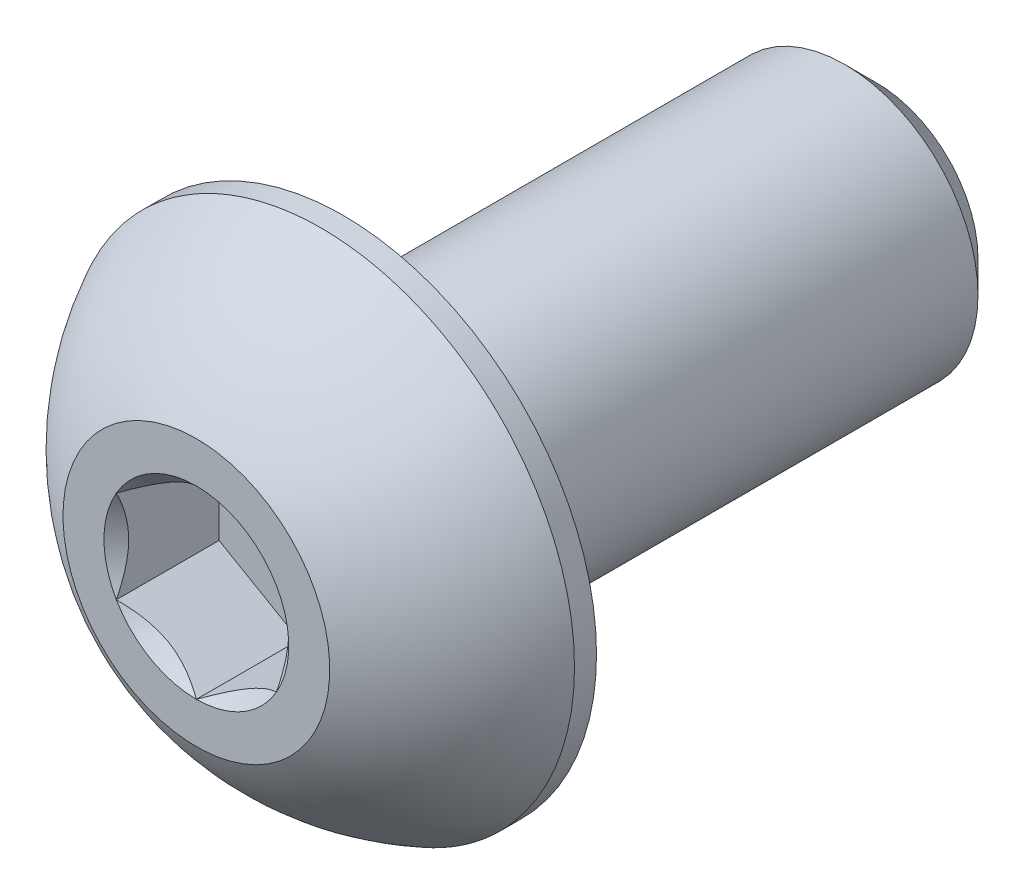
ISO-10303-21;
HEADER;
FILE_DESCRIPTION(('STEP AP214'),'2;1');
FILE_NAME('part.step','',(''),(''),'','','');
FILE_SCHEMA(('AUTOMOTIVE_DESIGN { 1 0 10303 214 1 1 1 1 }'));
ENDSEC;
DATA;
#1=APPLICATION_CONTEXT('core data for automotive mechanical design processes');
#2=APPLICATION_PROTOCOL_DEFINITION('international standard','automotive_design',2000,#1);
#3=PRODUCT_CONTEXT('',#1,'mechanical');
#4=PRODUCT('Part','Part','',(#3));
#5=PRODUCT_RELATED_PRODUCT_CATEGORY('part','',(#4));
#6=PRODUCT_DEFINITION_FORMATION('','',#4);
#7=PRODUCT_DEFINITION_CONTEXT('part definition',#1,'design');
#8=PRODUCT_DEFINITION('design','',#6,#7);
#9=PRODUCT_DEFINITION_SHAPE('','',#8);
#10=(LENGTH_UNIT() NAMED_UNIT(*) SI_UNIT(.MILLI.,.METRE.));
#11=(NAMED_UNIT(*) PLANE_ANGLE_UNIT() SI_UNIT($,.RADIAN.));
#12=(NAMED_UNIT(*) SI_UNIT($,.STERADIAN.) SOLID_ANGLE_UNIT());
#13=UNCERTAINTY_MEASURE_WITH_UNIT(LENGTH_MEASURE(1.E-05),#10,'distance_accuracy_value','');
#14=(GEOMETRIC_REPRESENTATION_CONTEXT(3) GLOBAL_UNCERTAINTY_ASSIGNED_CONTEXT((#13)) GLOBAL_UNIT_ASSIGNED_CONTEXT((#10,
#11,#12)) REPRESENTATION_CONTEXT('',''));
#15=CARTESIAN_POINT('',(0.,0.,0.));
#16=DIRECTION('',(0.,0.,1.));
#17=DIRECTION('',(1.,0.,0.));
#18=AXIS2_PLACEMENT_3D('',#15,#16,#17);
#19=CARTESIAN_POINT('',(1.5,-0.866025403784438,-1.925));
#20=DIRECTION('',(0.,0.,1.));
#21=DIRECTION('',(1.,0.,0.));
#22=AXIS2_PLACEMENT_3D('',#19,#20,#21);
#23=PLANE('',#22);
#24=DIRECTION('',(0.,1.,0.));
#25=VECTOR('',#24,1.);
#26=CARTESIAN_POINT('',(-1.5,0.866025403784438,-1.925));
#27=LINE('',#26,#25);
#28=CARTESIAN_POINT('',(-1.5,0.866025403784439,-1.925));
#29=VERTEX_POINT('',#28);
#30=CARTESIAN_POINT('',(-1.5,-0.866025403784439,-1.925));
#31=VERTEX_POINT('',#30);
#32=EDGE_CURVE('E77',#29,#31,#27,.F.);
#33=ORIENTED_EDGE('',*,*,#32,.T.);
#34=DIRECTION('',(0.866025403784439,-0.5,0.));
#35=VECTOR('',#34,1.);
#36=CARTESIAN_POINT('',(-1.5,-0.866025403784439,-1.925));
#37=LINE('',#36,#35);
#38=CARTESIAN_POINT('',(0.,-1.73205080756888,-1.925));
#39=VERTEX_POINT('',#38);
#40=EDGE_CURVE('E95',#31,#39,#37,.T.);
#41=ORIENTED_EDGE('',*,*,#40,.T.);
#42=DIRECTION('',(0.866025403784438,0.5,0.));
#43=VECTOR('',#42,1.);
#44=CARTESIAN_POINT('',(0.,-1.73205080756888,-1.925));
#45=LINE('',#44,#43);
#46=CARTESIAN_POINT('',(1.5,-0.866025403784439,-1.925));
#47=VERTEX_POINT('',#46);
#48=EDGE_CURVE('E98',#39,#47,#45,.T.);
#49=ORIENTED_EDGE('',*,*,#48,.T.);
#50=DIRECTION('',(0.,1.,0.));
#51=VECTOR('',#50,1.);
#52=CARTESIAN_POINT('',(1.5,-0.866025403784438,-1.925));
#53=LINE('',#52,#51);
#54=CARTESIAN_POINT('',(1.5,0.866025403784439,-1.925));
#55=VERTEX_POINT('',#54);
#56=EDGE_CURVE('E109',#47,#55,#53,.T.);
#57=ORIENTED_EDGE('',*,*,#56,.T.);
#58=DIRECTION('',(-0.866025403784439,0.5,0.));
#59=VECTOR('',#58,1.);
#60=CARTESIAN_POINT('',(1.5,0.866025403784439,-1.925));
#61=LINE('',#60,#59);
#62=CARTESIAN_POINT('',(0.,1.73205080756888,-1.925));
#63=VERTEX_POINT('',#62);
#64=EDGE_CURVE('E295',#55,#63,#61,.T.);
#65=ORIENTED_EDGE('',*,*,#64,.T.);
#66=DIRECTION('',(-0.866025403784438,-0.5,0.));
#67=VECTOR('',#66,1.);
#68=CARTESIAN_POINT('',(0.,1.73205080756888,-1.925));
#69=LINE('',#68,#67);
#70=EDGE_CURVE('E82',#63,#29,#69,.T.);
#71=ORIENTED_EDGE('',*,*,#70,.T.);
#72=EDGE_LOOP('',(#33,#41,#49,#57,#65,#71));
#73=FACE_BOUND('',#72,.T.);
#74=ADVANCED_FACE('F17',(#73),#23,.T.);
#75=CARTESIAN_POINT('',(-1.5,-0.866025403784439,-1.925));
#76=DIRECTION('',(-0.5,-0.866025403784439,0.));
#77=DIRECTION('',(0.866025403784439,-0.5,0.));
#78=AXIS2_PLACEMENT_3D('',#75,#76,#77);
#79=PLANE('',#78);
#80=CARTESIAN_POINT('',(-1.50000000002453,-0.866025403770048,-3.49730883349403E-11));
#81=CARTESIAN_POINT('',(-1.44844426727117,-0.895791119953617,-0.0297371504849993));
#82=CARTESIAN_POINT('',(-1.39602652187328,-0.926054519369461,-0.0577274997332096));
#83=CARTESIAN_POINT('',(-1.28914135977816,-0.9877646964775,-0.108976634295228));
#84=CARTESIAN_POINT('',(-1.23466378385068,-1.01921733960401,-0.132206913925155));
#85=CARTESIAN_POINT('',(-1.12481242363947,-1.08264005199279,-0.172000539063643));
#86=CARTESIAN_POINT('',(-1.06946660011449,-1.11459397810346,-0.188663877355987));
#87=CARTESIAN_POINT('',(-0.95755685533188,-1.17920509937865,-0.214336924391904));
#88=CARTESIAN_POINT('',(-0.900996350293105,-1.21186032218828,-0.223365789908325));
#89=CARTESIAN_POINT('',(-0.803509072843295,-1.26814462806649,-0.231512589340654));
#90=CARTESIAN_POINT('',(-0.762708138141556,-1.29170105869973,-0.232718117543908));
#91=CARTESIAN_POINT('',(-0.68117834074718,-1.33877230917235,-0.230683861819339));
#92=CARTESIAN_POINT('',(-0.640449495964758,-1.36228711867126,-0.22744309593466));
#93=CARTESIAN_POINT('',(-0.559384065201953,-1.40909026694414,-0.216702694706976));
#94=CARTESIAN_POINT('',(-0.51904787950441,-1.4323783746147,-0.20919909909419));
#95=CARTESIAN_POINT('',(-0.439052551258332,-1.47856369891149,-0.19034052638936));
#96=CARTESIAN_POINT('',(-0.399393706909126,-1.50146074337225,-0.178983896683506));
#97=CARTESIAN_POINT('',(-0.297850129661508,-1.56008695503064,-0.145281418581615));
#98=CARTESIAN_POINT('',(-0.236594120185608,-1.59545312859103,-0.120399016466317));
#99=CARTESIAN_POINT('',(-0.146523888893023,-1.64745520087378,-0.0783962697862533));
#100=CARTESIAN_POINT('',(-0.116842951449675,-1.6645914980965,-0.0636393457173694));
#101=CARTESIAN_POINT('',(-0.0580266310224323,-1.69854911652791,-0.0327784720806824));
#102=CARTESIAN_POINT('',(-0.0288909964375011,-1.71537058299853,-0.0166751634684283));
#103=CARTESIAN_POINT('',(2.46562120663875E-11,-1.73205080758311,-3.5066995750627E-11));
#104=B_SPLINE_CURVE_WITH_KNOTS('',3,(#80,#81,#82,#83,#84,#85,#86,#87,#88,#89,#90,#91,#92,#93,
#94,#95,#96,#97,#98,#99,#100,#101,#102,#103),.UNSPECIFIED.,.F.,.F.,(4,2,2,2,2,2,2,2,2,2,2,4),
(0.,0.199774419910088,0.4007123122777,0.598459990337994,0.795709985707602,0.936894690871223,
1.07811058146816,1.21945788001607,1.36086588096647,1.58533909988034,1.69726364731887,
1.80913521242832),.UNSPECIFIED.);
#105=CARTESIAN_POINT('',(-1.50000000002135,-0.866025403796764,-2.4651077774769E-11));
#106=VERTEX_POINT('',#105);
#107=CARTESIAN_POINT('',(-3.03592605946672E-11,-1.73205080760065,-1.75295343369276E-11));
#108=VERTEX_POINT('',#107);
#109=EDGE_CURVE('E20',#106,#108,#104,.T.);
#110=ORIENTED_EDGE('',*,*,#109,.T.);
#111=DIRECTION('',(0.,0.,1.));
#112=VECTOR('',#111,1.);
#113=CARTESIAN_POINT('',(0.,-1.73205080756888,-1.925));
#114=LINE('',#113,#112);
#115=EDGE_CURVE('E103',#108,#39,#114,.F.);
#116=ORIENTED_EDGE('',*,*,#115,.T.);
#117=ORIENTED_EDGE('',*,*,#40,.F.);
#118=DIRECTION('',(0.,0.,1.));
#119=VECTOR('',#118,1.);
#120=CARTESIAN_POINT('',(-1.5,-0.866025403784439,-1.925));
#121=LINE('',#120,#119);
#122=EDGE_CURVE('E67',#31,#106,#121,.T.);
#123=ORIENTED_EDGE('',*,*,#122,.T.);
#124=EDGE_LOOP('',(#110,#116,#117,#123));
#125=FACE_BOUND('',#124,.T.);
#126=ADVANCED_FACE('F104',(#125),#79,.F.);
#127=CARTESIAN_POINT('',(0.,-1.73205080756888,-1.925));
#128=DIRECTION('',(0.5,-0.866025403784438,0.));
#129=DIRECTION('',(0.866025403784438,0.5,0.));
#130=AXIS2_PLACEMENT_3D('',#127,#128,#129);
#131=PLANE('',#130);
#132=CARTESIAN_POINT('',(-2.47283241622989E-11,-1.73205080758293,-3.49712886177983E-11));
#133=CARTESIAN_POINT('',(0.0515557327287634,-1.70228509139958,-0.0297371504849972));
#134=CARTESIAN_POINT('',(0.103973478126704,-1.67202169198382,-0.0577274997332075));
#135=CARTESIAN_POINT('',(0.210858640221864,-1.61031151487585,-0.108976634295226));
#136=CARTESIAN_POINT('',(0.265336216149329,-1.57885887174931,-0.132206913925153));
#137=CARTESIAN_POINT('',(0.375187576360524,-1.51543615936052,-0.172000539063641));
#138=CARTESIAN_POINT('',(0.430533399885509,-1.48348223324986,-0.188663877355984));
#139=CARTESIAN_POINT('',(0.542443144668122,-1.41887111197467,-0.214336924391901));
#140=CARTESIAN_POINT('',(0.599003649706896,-1.38621588916504,-0.223365789908323));
#141=CARTESIAN_POINT('',(0.696490927156706,-1.32993158328682,-0.231512589340651));
#142=CARTESIAN_POINT('',(0.737291861858445,-1.30637515265359,-0.232718117543906));
#143=CARTESIAN_POINT('',(0.818821659252821,-1.25930390218097,-0.230683861819337));
#144=CARTESIAN_POINT('',(0.859550504035243,-1.23578909268205,-0.227443095934658));
#145=CARTESIAN_POINT('',(0.940615934798048,-1.18898594440918,-0.216702694706974));
#146=CARTESIAN_POINT('',(0.980952120495591,-1.16569783673862,-0.209199099094188));
#147=CARTESIAN_POINT('',(1.06094744874167,-1.11951251244183,-0.190340526389358));
#148=CARTESIAN_POINT('',(1.10060629309087,-1.09661546798107,-0.178983896683504));
#149=CARTESIAN_POINT('',(1.20214987033849,-1.03798925632268,-0.145281418581614));
#150=CARTESIAN_POINT('',(1.26340587981439,-1.00262308276228,-0.120399016466316));
#151=CARTESIAN_POINT('',(1.35347611110698,-0.950621010479539,-0.0783962697862523));
#152=CARTESIAN_POINT('',(1.38315704855032,-0.933484713256822,-0.0636393457173685));
#153=CARTESIAN_POINT('',(1.44197336897757,-0.89952709482541,-0.0327784720806818));
#154=CARTESIAN_POINT('',(1.4711090035625,-0.882705628354789,-0.0166751634684277));
#155=CARTESIAN_POINT('',(1.50000000002466,-0.866025403770206,-3.50662371950392E-11));
#156=B_SPLINE_CURVE_WITH_KNOTS('',3,(#132,#133,#134,#135,#136,#137,#138,#139,#140,#141,#142,
#143,#144,#145,#146,#147,#148,#149,#150,#151,#152,#153,#154,#155),.UNSPECIFIED.,.F.,.F.,(4,2,2,
2,2,2,2,2,2,2,2,4),(0.,0.199774419910088,0.400712312277699,0.598459990337993,0.795709985707601,
0.936894690871222,1.07811058146816,1.21945788001607,1.36086588096647,1.58533909988034,
1.69726364731887,1.80913521242832),.UNSPECIFIED.);
#157=CARTESIAN_POINT('',(1.50000000001233,-0.866025403826621,-1.7529131224469E-11));
#158=VERTEX_POINT('',#157);
#159=EDGE_CURVE('E228',#108,#158,#156,.T.);
#160=ORIENTED_EDGE('',*,*,#159,.T.);
#161=DIRECTION('',(0.,0.,-1.));
#162=VECTOR('',#161,1.);
#163=CARTESIAN_POINT('',(1.5,-0.866025403784439,-1.925));
#164=LINE('',#163,#162);
#165=EDGE_CURVE('E113',#158,#47,#164,.T.);
#166=ORIENTED_EDGE('',*,*,#165,.T.);
#167=ORIENTED_EDGE('',*,*,#48,.F.);
#168=ORIENTED_EDGE('',*,*,#115,.F.);
#169=EDGE_LOOP('',(#160,#166,#167,#168));
#170=FACE_BOUND('',#169,.T.);
#171=ADVANCED_FACE('F111',(#170),#131,.F.);
#172=CARTESIAN_POINT('',(1.5,-0.866025403784438,-1.925));
#173=DIRECTION('',(1.,0.,0.));
#174=DIRECTION('',(0.,0.,-1.));
#175=AXIS2_PLACEMENT_3D('',#172,#173,#174);
#176=PLANE('',#175);
#177=CARTESIAN_POINT('',(1.4999999999998,-0.866025403812882,-3.49731948477309E-11));
#178=CARTESIAN_POINT('',(1.49999999999993,-0.806493971458483,-0.0297371504859726));
#179=CARTESIAN_POINT('',(1.49999999999998,-0.745967172639481,-0.0577274997356718));
#180=CARTESIAN_POINT('',(1.50000000000002,-0.622546818448653,-0.108976634302055));
#181=CARTESIAN_POINT('',(1.50000000000001,-0.559641532208188,-0.132206913934862));
#182=CARTESIAN_POINT('',(1.5,-0.432796107455125,-0.172000539080811));
#183=CARTESIAN_POINT('',(1.5,-0.368888255245699,-0.188663877377684));
#184=CARTESIAN_POINT('',(1.5,-0.239666012718551,-0.214336924424236));
#185=CARTESIAN_POINT('',(1.5,-0.174355567110582,-0.223365789946761));
#186=CARTESIAN_POINT('',(1.5,-0.0617869553803679,-0.231512589389946));
#187=CARTESIAN_POINT('',(1.5,-0.0146740941290628,-0.232718117598397));
#188=CARTESIAN_POINT('',(1.5,0.0794684067864031,-0.230683861885897));
#189=CARTESIAN_POINT('',(1.5,0.126498025769629,-0.227443096008093));
#190=CARTESIAN_POINT('',(1.5,0.22010432228685,-0.21670269479537));
#191=CARTESIAN_POINT('',(1.5,0.266680537614034,-0.209199099190673));
#192=CARTESIAN_POINT('',(1.5,0.359051186180354,-0.190340526502742));
#193=CARTESIAN_POINT('',(1.5,0.404845275088565,-0.178983896805698));
#194=CARTESIAN_POINT('',(1.5,0.522097698449399,-0.145281418704612));
#195=CARTESIAN_POINT('',(1.5,0.592830045625335,-0.120399016572433));
#196=CARTESIAN_POINT('',(1.5,0.69683419026976,-0.0783962698582894));
#197=CARTESIAN_POINT('',(1.5,0.731106784740956,-0.0636393457765502));
#198=CARTESIAN_POINT('',(1.5,0.799022021654026,-0.0327784721118594));
#199=CARTESIAN_POINT('',(1.5,0.832664954619755,-0.0166751634844621));
#200=CARTESIAN_POINT('',(1.5,0.866025403812908,-3.5067301240063E-11));
#201=B_SPLINE_CURVE_WITH_KNOTS('',3,(#177,#178,#179,#180,#181,#182,#183,#184,#185,#186,#187,
#188,#189,#190,#191,#192,#193,#194,#195,#196,#197,#198,#199,#200),.UNSPECIFIED.,.F.,.F.,(4,2,2,
2,2,2,2,2,2,2,2,4),(0.,0.199774419877746,0.400712312213007,0.598459990242251,0.795709985580833,
0.936894690699465,1.07811058125136,1.21945787975417,1.36086588065946,1.58533909974464,
1.69726364726936,1.80913521246463),.UNSPECIFIED.);
#202=CARTESIAN_POINT('',(1.5000000000427,0.866025403774031,-1.75296331798823E-11));
#203=VERTEX_POINT('',#202);
#204=EDGE_CURVE('E210',#158,#203,#201,.T.);
#205=ORIENTED_EDGE('',*,*,#204,.T.);
#206=DIRECTION('',(0.,0.,1.));
#207=VECTOR('',#206,1.);
#208=CARTESIAN_POINT('',(1.5,0.866025403784439,-1.925));
#209=LINE('',#208,#207);
#210=EDGE_CURVE('E291',#203,#55,#209,.F.);
#211=ORIENTED_EDGE('',*,*,#210,.T.);
#212=ORIENTED_EDGE('',*,*,#56,.F.);
#213=ORIENTED_EDGE('',*,*,#165,.F.);
#214=EDGE_LOOP('',(#205,#211,#212,#213));
#215=FACE_BOUND('',#214,.T.);
#216=ADVANCED_FACE('F199',(#215),#176,.F.);
#217=CARTESIAN_POINT('',(1.5,0.866025403784439,-1.925));
#218=DIRECTION('',(0.5,0.866025403784439,0.));
#219=DIRECTION('',(-0.866025403784439,0.5,0.));
#220=AXIS2_PLACEMENT_3D('',#217,#218,#219);
#221=PLANE('',#220);
#222=CARTESIAN_POINT('',(1.50000000002453,0.866025403770048,-3.4973253111955E-11));
#223=CARTESIAN_POINT('',(1.44844426727117,0.895791119953617,-0.0297371504849994));
#224=CARTESIAN_POINT('',(1.39602652187328,0.926054519369461,-0.0577274997332097));
#225=CARTESIAN_POINT('',(1.28914135977816,0.987764696477501,-0.108976634295228));
#226=CARTESIAN_POINT('',(1.23466378385068,1.01921733960401,-0.132206913925155));
#227=CARTESIAN_POINT('',(1.12481242363947,1.08264005199279,-0.172000539063643));
#228=CARTESIAN_POINT('',(1.06946660011449,1.11459397810346,-0.188663877355987));
#229=CARTESIAN_POINT('',(0.95755685533188,1.17920509937865,-0.214336924391904));
#230=CARTESIAN_POINT('',(0.900996350293104,1.21186032218828,-0.223365789908325));
#231=CARTESIAN_POINT('',(0.803509072843295,1.26814462806649,-0.231512589340654));
#232=CARTESIAN_POINT('',(0.762708138141556,1.29170105869973,-0.232718117543908));
#233=CARTESIAN_POINT('',(0.68117834074718,1.33877230917235,-0.230683861819339));
#234=CARTESIAN_POINT('',(0.640449495964758,1.36228711867126,-0.22744309593466));
#235=CARTESIAN_POINT('',(0.559384065201953,1.40909026694414,-0.216702694706976));
#236=CARTESIAN_POINT('',(0.51904787950441,1.4323783746147,-0.20919909909419));
#237=CARTESIAN_POINT('',(0.439052551258333,1.47856369891149,-0.19034052638936));
#238=CARTESIAN_POINT('',(0.399393706909126,1.50146074337225,-0.178983896683506));
#239=CARTESIAN_POINT('',(0.297850129661507,1.56008695503064,-0.145281418581616));
#240=CARTESIAN_POINT('',(0.236594120185608,1.59545312859103,-0.120399016466317));
#241=CARTESIAN_POINT('',(0.146523888893023,1.64745520087378,-0.0783962697862531));
#242=CARTESIAN_POINT('',(0.116842951449674,1.6645914980965,-0.0636393457173692));
#243=CARTESIAN_POINT('',(0.0580266310224316,1.69854911652791,-0.0327784720806821));
#244=CARTESIAN_POINT('',(0.0288909964375004,1.71537058299853,-0.0166751634684281));
#245=CARTESIAN_POINT('',(-2.46568834570738E-11,1.73205080758311,-3.50665978158375E-11));
#246=B_SPLINE_CURVE_WITH_KNOTS('',3,(#222,#223,#224,#225,#226,#227,#228,#229,#230,#231,#232,
#233,#234,#235,#236,#237,#238,#239,#240,#241,#242,#243,#244,#245),.UNSPECIFIED.,.F.,.F.,(4,2,2,
2,2,2,2,2,2,2,2,4),(0.,0.199774419910088,0.400712312277699,0.598459990337994,0.795709985707602,
0.936894690871222,1.07811058146816,1.21945788001607,1.36086588096647,1.58533909988034,
1.69726364731887,1.80913521242832),.UNSPECIFIED.);
#247=CARTESIAN_POINT('',(3.03590397906963E-11,1.73205080760065,-1.75294164449582E-11));
#248=VERTEX_POINT('',#247);
#249=EDGE_CURVE('E203',#203,#248,#246,.T.);
#250=ORIENTED_EDGE('',*,*,#249,.T.);
#251=DIRECTION('',(0.,0.,1.));
#252=VECTOR('',#251,1.);
#253=CARTESIAN_POINT('',(0.,1.73205080756888,-1.925));
#254=LINE('',#253,#252);
#255=EDGE_CURVE('E286',#248,#63,#254,.F.);
#256=ORIENTED_EDGE('',*,*,#255,.T.);
#257=ORIENTED_EDGE('',*,*,#64,.F.);
#258=ORIENTED_EDGE('',*,*,#210,.F.);
#259=EDGE_LOOP('',(#250,#256,#257,#258));
#260=FACE_BOUND('',#259,.T.);
#261=ADVANCED_FACE('F195',(#260),#221,.F.);
#262=CARTESIAN_POINT('',(0.,1.73205080756888,-1.925));
#263=DIRECTION('',(-0.5,0.866025403784438,0.));
#264=DIRECTION('',(-0.866025403784438,-0.5,0.));
#265=AXIS2_PLACEMENT_3D('',#262,#263,#264);
#266=PLANE('',#265);
#267=CARTESIAN_POINT('',(2.47278634993487E-11,1.73205080758293,-3.49716904690521E-11));
#268=CARTESIAN_POINT('',(-0.0515557327287638,1.70228509139958,-0.0297371504849977));
#269=CARTESIAN_POINT('',(-0.103973478126705,1.67202169198382,-0.0577274997332079));
#270=CARTESIAN_POINT('',(-0.210858640221864,1.61031151487585,-0.108976634295226));
#271=CARTESIAN_POINT('',(-0.26533621614933,1.57885887174931,-0.132206913925153));
#272=CARTESIAN_POINT('',(-0.375187576360525,1.51543615936052,-0.172000539063641));
#273=CARTESIAN_POINT('',(-0.430533399885509,1.48348223324986,-0.188663877355985));
#274=CARTESIAN_POINT('',(-0.542443144668123,1.41887111197467,-0.214336924391901));
#275=CARTESIAN_POINT('',(-0.599003649706897,1.38621588916504,-0.223365789908323));
#276=CARTESIAN_POINT('',(-0.696490927156706,1.32993158328682,-0.231512589340651));
#277=CARTESIAN_POINT('',(-0.737291861858445,1.30637515265359,-0.232718117543906));
#278=CARTESIAN_POINT('',(-0.818821659252822,1.25930390218097,-0.230683861819337));
#279=CARTESIAN_POINT('',(-0.859550504035244,1.23578909268205,-0.227443095934658));
#280=CARTESIAN_POINT('',(-0.940615934798048,1.18898594440918,-0.216702694706974));
#281=CARTESIAN_POINT('',(-0.980952120495591,1.16569783673862,-0.209199099094188));
#282=CARTESIAN_POINT('',(-1.06094744874167,1.11951251244183,-0.190340526389358));
#283=CARTESIAN_POINT('',(-1.10060629309088,1.09661546798107,-0.178983896683504));
#284=CARTESIAN_POINT('',(-1.20214987033849,1.03798925632268,-0.145281418581613));
#285=CARTESIAN_POINT('',(-1.26340587981439,1.00262308276228,-0.120399016466315));
#286=CARTESIAN_POINT('',(-1.35347611110698,0.950621010479539,-0.0783962697862516));
#287=CARTESIAN_POINT('',(-1.38315704855033,0.933484713256821,-0.0636393457173678));
#288=CARTESIAN_POINT('',(-1.44197336897757,0.899527094825409,-0.0327784720806811));
#289=CARTESIAN_POINT('',(-1.4711090035625,0.882705628354789,-0.0166751634684272));
#290=CARTESIAN_POINT('',(-1.50000000002466,0.866025403770206,-3.50659196153753E-11));
#291=B_SPLINE_CURVE_WITH_KNOTS('',3,(#267,#268,#269,#270,#271,#272,#273,#274,#275,#276,#277,
#278,#279,#280,#281,#282,#283,#284,#285,#286,#287,#288,#289,#290),.UNSPECIFIED.,.F.,.F.,(4,2,2,
2,2,2,2,2,2,2,2,4),(0.,0.199774419910088,0.400712312277699,0.598459990337993,0.795709985707601,
0.936894690871222,1.07811058146816,1.21945788001607,1.36086588096647,1.58533909988034,
1.69726364731887,1.80913521242832),.UNSPECIFIED.);
#292=CARTESIAN_POINT('',(-1.50000000001233,0.86602540382662,-1.75290210342841E-11));
#293=VERTEX_POINT('',#292);
#294=EDGE_CURVE('E45',#248,#293,#291,.T.);
#295=ORIENTED_EDGE('',*,*,#294,.T.);
#296=DIRECTION('',(0.,0.,1.));
#297=VECTOR('',#296,1.);
#298=CARTESIAN_POINT('',(-1.5,0.866025403784438,-1.925));
#299=LINE('',#298,#297);
#300=EDGE_CURVE('E277',#293,#29,#299,.F.);
#301=ORIENTED_EDGE('',*,*,#300,.T.);
#302=ORIENTED_EDGE('',*,*,#70,.F.);
#303=ORIENTED_EDGE('',*,*,#255,.F.);
#304=EDGE_LOOP('',(#295,#301,#302,#303));
#305=FACE_BOUND('',#304,.T.);
#306=ADVANCED_FACE('F188',(#305),#266,.F.);
#307=CARTESIAN_POINT('',(-1.5,0.866025403784438,-1.925));
#308=DIRECTION('',(-1.,0.,0.));
#309=DIRECTION('',(0.,0.,1.));
#310=AXIS2_PLACEMENT_3D('',#307,#308,#309);
#311=PLANE('',#310);
#312=CARTESIAN_POINT('',(-1.4999999999998,0.866025403812881,-3.49736894377255E-11));
#313=CARTESIAN_POINT('',(-1.49999999999993,0.806493971458482,-0.0297371504859727));
#314=CARTESIAN_POINT('',(-1.49999999999998,0.74596717263948,-0.0577274997356719));
#315=CARTESIAN_POINT('',(-1.50000000000002,0.622546818448652,-0.108976634302056));
#316=CARTESIAN_POINT('',(-1.50000000000001,0.559641532208187,-0.132206913934863));
#317=CARTESIAN_POINT('',(-1.5,0.432796107455124,-0.172000539080812));
#318=CARTESIAN_POINT('',(-1.5,0.368888255245698,-0.188663877377684));
#319=CARTESIAN_POINT('',(-1.5,0.23966601271855,-0.214336924424236));
#320=CARTESIAN_POINT('',(-1.5,0.174355567110582,-0.223365789946761));
#321=CARTESIAN_POINT('',(-1.5,0.0617869553803675,-0.231512589389946));
#322=CARTESIAN_POINT('',(-1.5,0.0146740941290625,-0.232718117598397));
#323=CARTESIAN_POINT('',(-1.5,-0.0794684067864032,-0.230683861885897));
#324=CARTESIAN_POINT('',(-1.5,-0.126498025769629,-0.227443096008093));
#325=CARTESIAN_POINT('',(-1.5,-0.22010432228685,-0.21670269479537));
#326=CARTESIAN_POINT('',(-1.5,-0.266680537614034,-0.209199099190673));
#327=CARTESIAN_POINT('',(-1.5,-0.359051186180354,-0.190340526502742));
#328=CARTESIAN_POINT('',(-1.5,-0.404845275088566,-0.178983896805698));
#329=CARTESIAN_POINT('',(-1.5,-0.522097698449399,-0.145281418704612));
#330=CARTESIAN_POINT('',(-1.5,-0.592830045625335,-0.120399016572433));
#331=CARTESIAN_POINT('',(-1.5,-0.69683419026976,-0.0783962698582894));
#332=CARTESIAN_POINT('',(-1.5,-0.731106784740956,-0.0636393457765503));
#333=CARTESIAN_POINT('',(-1.5,-0.799022021654026,-0.0327784721118596));
#334=CARTESIAN_POINT('',(-1.5,-0.832664954619755,-0.0166751634844622));
#335=CARTESIAN_POINT('',(-1.5,-0.866025403812908,-3.50673251714009E-11));
#336=B_SPLINE_CURVE_WITH_KNOTS('',3,(#312,#313,#314,#315,#316,#317,#318,#319,#320,#321,#322,
#323,#324,#325,#326,#327,#328,#329,#330,#331,#332,#333,#334,#335),.UNSPECIFIED.,.F.,.F.,(4,2,2,
2,2,2,2,2,2,2,2,4),(0.,0.199774419877746,0.400712312213007,0.598459990242251,0.795709985580833,
0.936894690699464,1.07811058125136,1.21945787975417,1.36086588065945,1.58533909974464,
1.69726364726936,1.80913521246463),.UNSPECIFIED.);
#337=EDGE_CURVE('E167',#293,#106,#336,.T.);
#338=ORIENTED_EDGE('',*,*,#337,.T.);
#339=ORIENTED_EDGE('',*,*,#122,.F.);
#340=ORIENTED_EDGE('',*,*,#32,.F.);
#341=ORIENTED_EDGE('',*,*,#300,.F.);
#342=EDGE_LOOP('',(#338,#339,#340,#341));
#343=FACE_BOUND('',#342,.T.);
#344=ADVANCED_FACE('F184',(#343),#311,.F.);
#345=CARTESIAN_POINT('',(0.,0.,0.));
#346=DIRECTION('',(0.,0.,1.));
#347=DIRECTION('',(1.,0.,0.));
#348=AXIS2_PLACEMENT_3D('',#345,#346,#347);
#349=CONICAL_SURFACE('',#348,1.73205080761818,0.785398163519197);
#350=ORIENTED_EDGE('',*,*,#109,.F.);
#351=CARTESIAN_POINT('',(0.,0.,0.));
#352=DIRECTION('',(0.,0.,1.));
#353=DIRECTION('',(1.,0.,0.));
#354=AXIS2_PLACEMENT_3D('',#351,#352,#353);
#355=CIRCLE('',#354,1.73205080761818);
#356=EDGE_CURVE('E176',#106,#108,#355,.T.);
#357=ORIENTED_EDGE('',*,*,#356,.T.);
#358=EDGE_LOOP('',(#350,#357));
#359=FACE_BOUND('',#358,.T.);
#360=ADVANCED_FACE('F187',(#359),#349,.F.);
#361=CARTESIAN_POINT('',(0.,0.,0.));
#362=DIRECTION('',(0.,0.,1.));
#363=DIRECTION('',(1.,0.,0.));
#364=AXIS2_PLACEMENT_3D('',#361,#362,#363);
#365=CONICAL_SURFACE('',#364,1.73205080761818,0.785398163519197);
#366=ORIENTED_EDGE('',*,*,#159,.F.);
#367=CARTESIAN_POINT('',(0.,0.,0.));
#368=DIRECTION('',(0.,0.,1.));
#369=DIRECTION('',(1.,0.,0.));
#370=AXIS2_PLACEMENT_3D('',#367,#368,#369);
#371=CIRCLE('',#370,1.73205080761818);
#372=EDGE_CURVE('E340',#108,#158,#371,.T.);
#373=ORIENTED_EDGE('',*,*,#372,.T.);
#374=EDGE_LOOP('',(#366,#373));
#375=FACE_BOUND('',#374,.T.);
#376=ADVANCED_FACE('F223',(#375),#365,.F.);
#377=CARTESIAN_POINT('',(0.,0.,0.));
#378=DIRECTION('',(0.,0.,1.));
#379=DIRECTION('',(1.,0.,0.));
#380=AXIS2_PLACEMENT_3D('',#377,#378,#379);
#381=CONICAL_SURFACE('',#380,1.73205080761818,0.785398163397448);
#382=CARTESIAN_POINT('',(0.,0.,0.));
#383=DIRECTION('',(0.,0.,1.));
#384=DIRECTION('',(1.,0.,0.));
#385=AXIS2_PLACEMENT_3D('',#382,#383,#384);
#386=CIRCLE('',#385,1.73205080761818);
#387=EDGE_CURVE('E344',#158,#203,#386,.T.);
#388=ORIENTED_EDGE('',*,*,#387,.T.);
#389=ORIENTED_EDGE('',*,*,#204,.F.);
#390=EDGE_LOOP('',(#388,#389));
#391=FACE_BOUND('',#390,.T.);
#392=ADVANCED_FACE('F219',(#391),#381,.F.);
#393=CARTESIAN_POINT('',(0.,0.,0.));
#394=DIRECTION('',(0.,0.,1.));
#395=DIRECTION('',(1.,0.,0.));
#396=AXIS2_PLACEMENT_3D('',#393,#394,#395);
#397=CONICAL_SURFACE('',#396,1.73205080761818,0.785398163519197);
#398=ORIENTED_EDGE('',*,*,#249,.F.);
#399=CARTESIAN_POINT('',(0.,0.,0.));
#400=DIRECTION('',(0.,0.,1.));
#401=DIRECTION('',(1.,0.,0.));
#402=AXIS2_PLACEMENT_3D('',#399,#400,#401);
#403=CIRCLE('',#402,1.73205080761818);
#404=EDGE_CURVE('E346',#203,#248,#403,.T.);
#405=ORIENTED_EDGE('',*,*,#404,.T.);
#406=EDGE_LOOP('',(#398,#405));
#407=FACE_BOUND('',#406,.T.);
#408=ADVANCED_FACE('F216',(#407),#397,.F.);
#409=CARTESIAN_POINT('',(0.,0.,0.));
#410=DIRECTION('',(0.,0.,1.));
#411=DIRECTION('',(1.,0.,0.));
#412=AXIS2_PLACEMENT_3D('',#409,#410,#411);
#413=CONICAL_SURFACE('',#412,1.73205080761818,0.785398163519197);
#414=ORIENTED_EDGE('',*,*,#294,.F.);
#415=CARTESIAN_POINT('',(0.,0.,0.));
#416=DIRECTION('',(0.,0.,1.));
#417=DIRECTION('',(1.,0.,0.));
#418=AXIS2_PLACEMENT_3D('',#415,#416,#417);
#419=CIRCLE('',#418,1.73205080761818);
#420=EDGE_CURVE('E335',#248,#293,#419,.T.);
#421=ORIENTED_EDGE('',*,*,#420,.T.);
#422=EDGE_LOOP('',(#414,#421));
#423=FACE_BOUND('',#422,.T.);
#424=ADVANCED_FACE('F162',(#423),#413,.F.);
#425=CARTESIAN_POINT('',(0.,0.,0.));
#426=DIRECTION('',(0.,0.,1.));
#427=DIRECTION('',(1.,0.,0.));
#428=AXIS2_PLACEMENT_3D('',#425,#426,#427);
#429=CONICAL_SURFACE('',#428,1.73205080761818,0.785398163397448);
#430=ORIENTED_EDGE('',*,*,#337,.F.);
#431=CARTESIAN_POINT('',(0.,0.,0.));
#432=DIRECTION('',(0.,0.,1.));
#433=DIRECTION('',(1.,0.,0.));
#434=AXIS2_PLACEMENT_3D('',#431,#432,#433);
#435=CIRCLE('',#434,1.73205080761818);
#436=EDGE_CURVE('E147',#293,#106,#435,.T.);
#437=ORIENTED_EDGE('',*,*,#436,.T.);
#438=EDGE_LOOP('',(#430,#437));
#439=FACE_BOUND('',#438,.T.);
#440=ADVANCED_FACE('F157',(#439),#429,.F.);
#441=CARTESIAN_POINT('',(0.,-2.5,0.));
#442=DIRECTION('',(0.,0.,-1.));
#443=DIRECTION('',(-1.,0.,0.));
#444=AXIS2_PLACEMENT_3D('',#441,#442,#443);
#445=PLANE('',#444);
#446=ORIENTED_EDGE('',*,*,#420,.F.);
#447=ORIENTED_EDGE('',*,*,#404,.F.);
#448=ORIENTED_EDGE('',*,*,#387,.F.);
#449=ORIENTED_EDGE('',*,*,#372,.F.);
#450=ORIENTED_EDGE('',*,*,#356,.F.);
#451=ORIENTED_EDGE('',*,*,#436,.F.);
#452=EDGE_LOOP('',(#446,#447,#448,#449,#450,#451));
#453=FACE_BOUND('',#452,.T.);
#454=CARTESIAN_POINT('',(0.,2.5,0.));
#455=CARTESIAN_POINT('',(-0.140426104916171,2.49999377288615,0.));
#456=CARTESIAN_POINT('',(-0.280954031991962,2.48812860484106,3.15786606079497E-13));
#457=CARTESIAN_POINT('',(-0.558139658492382,2.44096074902969,-3.16166902160035E-13));
#458=CARTESIAN_POINT('',(-0.694792493265144,2.40562985309161,-1.1991938830655E-12));
#459=CARTESIAN_POINT('',(-0.960172122561447,2.31253633023374,-1.20166281841789E-12));
#460=CARTESIAN_POINT('',(-1.08890266852496,2.25478441650809,-3.21946211567848E-13));
#461=CARTESIAN_POINT('',(-1.33480476215494,2.11850293856874,3.21866212850881E-13));
#462=CARTESIAN_POINT('',(-1.45197917410753,2.03997854084975,0.));
#463=CARTESIAN_POINT('',(-1.67149637287936,1.86436525899232,0.));
#464=CARTESIAN_POINT('',(-1.77383760642256,1.76727443311113,0.));
#465=CARTESIAN_POINT('',(-1.96077108972063,1.5572853703438,0.));
#466=CARTESIAN_POINT('',(-2.04536264247664,1.44438651299413,0.));
#467=CARTESIAN_POINT('',(-2.19438926048053,1.20599153577204,0.));
#468=CARTESIAN_POINT('',(-2.2588247010994,1.08049565055392,0.));
#469=CARTESIAN_POINT('',(-2.36571190425968,0.820467575206641,0.));
#470=CARTESIAN_POINT('',(-2.40816371100576,0.685935403248265,0.));
#471=CARTESIAN_POINT('',(-2.46987884513361,0.41165323576608,0.));
#472=CARTESIAN_POINT('',(-2.4891421283097,0.271903230295725,0.));
#473=CARTESIAN_POINT('',(-2.50393321907299,-0.00884700938585766,0.));
#474=CARTESIAN_POINT('',(-2.49946106942909,-0.149847241343845,0.));
#475=CARTESIAN_POINT('',(-2.46690834048228,-0.429095661105703,0.));
#476=CARTESIAN_POINT('',(-2.43882775236998,-0.567343847882638,0.));
#477=CARTESIAN_POINT('',(-2.35985521676827,-0.837163810231991,0.));
#478=CARTESIAN_POINT('',(-2.30896324519902,-0.968735578756573,0.));
#479=CARTESIAN_POINT('',(-2.1858126315262,-1.2214675666181,0.));
#480=CARTESIAN_POINT('',(-2.11355399637579,-1.34262778934316,0.));
#481=CARTESIAN_POINT('',(-1.94972129370707,-1.57109730355804,0.));
#482=CARTESIAN_POINT('',(-1.85814723400701,-1.67840660065422,0.));
#483=CARTESIAN_POINT('',(-1.65828316813495,-1.87612814061528,0.));
#484=CARTESIAN_POINT('',(-1.54999315967219,-1.96654038116456,0.));
#485=CARTESIAN_POINT('',(-1.31977122488187,-2.12790126296045,0.));
#486=CARTESIAN_POINT('',(-1.19783929677156,-2.1988499016635,0.));
#487=CARTESIAN_POINT('',(-0.943794829063063,-2.31926953799949,0.));
#488=CARTESIAN_POINT('',(-0.811682289900767,-2.36874053655201,0.));
#489=CARTESIAN_POINT('',(-0.541026888337529,-2.44480055905629,0.));
#490=CARTESIAN_POINT('',(-0.402484026226278,-2.47138958403888,0.));
#491=CARTESIAN_POINT('',(-0.122900797575727,-2.50093087897621,0.));
#492=CARTESIAN_POINT('',(0.018139568963571,-2.50388314893098,3.46961945081868E-13));
#493=CARTESIAN_POINT('',(0.298714091660324,-2.48606712714886,-3.46961960712715E-13));
#494=CARTESIAN_POINT('',(0.438248247749923,-2.46529883434335,-1.29477243391078E-12));
#495=CARTESIAN_POINT('',(0.71184938433979,-2.40063123468837,-1.13730987603765E-12));
#496=CARTESIAN_POINT('',(0.845916364605969,-2.3567319268485,0.));
#497=CARTESIAN_POINT('',(1.10477735834655,-2.24704847617179,0.));
#498=CARTESIAN_POINT('',(1.22957137303277,-2.18126433619494,-1.00916257566668E-12));
#499=CARTESIAN_POINT('',(1.46634390401786,-2.02967864834023,-1.18352788602047E-12));
#500=CARTESIAN_POINT('',(1.57832242207297,-1.94387710320556,-3.16694129312418E-13));
#501=CARTESIAN_POINT('',(1.7862852822064,-1.7546922142879,3.16694257499622E-13));
#502=CARTESIAN_POINT('',(1.8822696178108,-1.6513088633884,0.));
#503=CARTESIAN_POINT('',(2.0555193719421,-1.42989510132749,0.));
#504=CARTESIAN_POINT('',(2.13278478437748,-1.31186468539964,0.));
#505=CARTESIAN_POINT('',(2.2664032406088,-1.06450749101075,0.));
#506=CARTESIAN_POINT('',(2.32275630647994,-0.935180724474359,0.));
#507=CARTESIAN_POINT('',(2.41295047224872,-0.668901974735228,0.));
#508=CARTESIAN_POINT('',(2.4467915805466,-0.531949994377824,0.));
#509=CARTESIAN_POINT('',(2.49100125494042,-0.254308178115884,0.));
#510=CARTESIAN_POINT('',(2.50136977874099,-0.11361833547654,0.));
#511=CARTESIAN_POINT('',(2.49833983643023,0.167504919749226,0.));
#512=CARTESIAN_POINT('',(2.48494141562714,0.307938332823983,0.));
#513=CARTESIAN_POINT('',(2.43475793877014,0.584562794538375,0.));
#514=CARTESIAN_POINT('',(2.39797283569016,0.720753834646847,0.));
#515=CARTESIAN_POINT('',(2.30205936796063,0.98502964653005,0.));
#516=CARTESIAN_POINT('',(2.24293058718862,1.1131142672812,0.));
#517=CARTESIAN_POINT('',(2.10401075902967,1.3575336098139,0.));
#518=CARTESIAN_POINT('',(2.02422052292125,1.47386879269154,0.));
#519=CARTESIAN_POINT('',(1.84625229096995,1.69148114008358,0.));
#520=CARTESIAN_POINT('',(1.74807621990901,1.79275987884252,0.));
#521=CARTESIAN_POINT('',(1.53608575842464,1.97742315380663,0.));
#522=CARTESIAN_POINT('',(1.42226748721669,2.06080323621403,0.));
#523=CARTESIAN_POINT('',(1.18220372565671,2.20730286771332,0.));
#524=CARTESIAN_POINT('',(1.05595232774905,2.27041272419885,0.));
#525=CARTESIAN_POINT('',(0.79474524318476,2.37446817640476,0.));
#526=CARTESIAN_POINT('',(0.659800208998089,2.41544034072841,0.));
#527=CARTESIAN_POINT('',(0.436662637238998,2.46313736176947,0.));
#528=CARTESIAN_POINT('',(0.349919997758221,2.47694359911888,0.));
#529=CARTESIAN_POINT('',(0.175464826042706,2.49537686389633,0.));
#530=CARTESIAN_POINT('',(0.0877522938079665,2.50000389132438,0.));
#531=CARTESIAN_POINT('',(0.,2.5,0.));
#532=B_SPLINE_CURVE_WITH_KNOTS('',3,(#454,#455,#456,#457,#458,#459,#460,#461,#462,#463,#464,
#465,#466,#467,#468,#469,#470,#471,#472,#473,#474,#475,#476,#477,#478,#479,#480,#481,#482,#483,
#484,#485,#486,#487,#488,#489,#490,#491,#492,#493,#494,#495,#496,#497,#498,#499,#500,#501,#502,
#503,#504,#505,#506,#507,#508,#509,#510,#511,#512,#513,#514,#515,#516,#517,#518,#519,#520,#521,
#522,#523,#524,#525,#526,#527,#528,#529,#530,#531),.UNSPECIFIED.,.T.,.F.,(4,2,2,2,2,2,2,2,2,2,2,
2,2,2,2,2,2,2,2,2,2,2,2,2,2,2,2,2,2,2,2,2,2,2,2,2,2,2,4),(0.,0.420958019059748,
0.842422990224611,1.26368682467408,1.68484598149402,2.10604920874208,2.52726897280856,
2.94848089195443,3.36969196412426,3.7909038392729,4.21211495543997,4.63332622878055,
5.05453794675567,5.47574952765963,5.89696093807138,6.31817240620663,6.73938392938708,
7.16059543453285,7.58180692070278,8.00301840687236,8.42422991201778,8.84544143519829,
9.26665290333358,9.68786431374594,10.1090758946506,10.5302876126258,10.9514988859663,
11.3727100021334,11.793921877282,12.2151329494518,12.6363448685977,13.0575646326643,
13.4787678599123,13.8999270167319,14.3211908511815,14.742655822347,15.1636138414069,
15.4266705700074,15.689727298608),.UNSPECIFIED.);
#533=CARTESIAN_POINT('',(0.,2.5,0.));
#534=VERTEX_POINT('',#533);
#535=EDGE_CURVE('E138',#534,#534,#532,.F.);
#536=ORIENTED_EDGE('',*,*,#535,.F.);
#537=EDGE_LOOP('',(#536));
#538=FACE_BOUND('',#537,.T.);
#539=ADVANCED_FACE('F153',(#453,#538),#445,.F.);
#540=CARTESIAN_POINT('',(0.,0.,-4.65805481283422));
#541=DIRECTION('',(0.,-1.,0.));
#542=DIRECTION('',(0.,0.,-1.));
#543=AXIS2_PLACEMENT_3D('',#540,#541,#542);
#544=SPHERICAL_SURFACE('',#543,5.28653711226622);
#545=ORIENTED_EDGE('',*,*,#535,.T.);
#546=EDGE_LOOP('',(#545));
#547=FACE_BOUND('',#546,.T.);
#548=CARTESIAN_POINT('',(0.,0.,-2.3375));
#549=DIRECTION('',(0.,0.,1.));
#550=DIRECTION('',(1.,0.,0.));
#551=AXIS2_PLACEMENT_3D('',#548,#549,#550);
#552=CIRCLE('',#551,4.75);
#553=CARTESIAN_POINT('',(4.75,0.,-2.3375));
#554=VERTEX_POINT('',#553);
#555=EDGE_CURVE('E134',#554,#554,#552,.F.);
#556=ORIENTED_EDGE('',*,*,#555,.F.);
#557=EDGE_LOOP('',(#556));
#558=FACE_BOUND('',#557,.T.);
#559=ADVANCED_FACE('F149',(#547,#558),#544,.T.);
#560=CARTESIAN_POINT('',(0.,-2.5,-12.75));
#561=DIRECTION('',(0.,0.,-1.));
#562=DIRECTION('',(0.,1.,0.));
#563=AXIS2_PLACEMENT_3D('',#560,#561,#562);
#564=PLANE('',#563);
#565=CARTESIAN_POINT('',(0.,0.,-12.7499999999827));
#566=DIRECTION('',(0.,0.,1.));
#567=DIRECTION('',(1.,0.,0.));
#568=AXIS2_PLACEMENT_3D('',#565,#566,#567);
#569=CIRCLE('',#568,1.89999999992096);
#570=CARTESIAN_POINT('',(1.89999999992096,0.,-12.7499999999827));
#571=VERTEX_POINT('',#570);
#572=EDGE_CURVE('E130',#571,#571,#569,.T.);
#573=ORIENTED_EDGE('',*,*,#572,.F.);
#574=EDGE_LOOP('',(#573));
#575=FACE_BOUND('',#574,.T.);
#576=ADVANCED_FACE('F259',(#575),#564,.T.);
#577=CARTESIAN_POINT('',(0.,0.,0.));
#578=DIRECTION('',(0.,0.,1.));
#579=DIRECTION('',(1.,0.,0.));
#580=AXIS2_PLACEMENT_3D('',#577,#578,#579);
#581=CYLINDRICAL_SURFACE('',#580,4.75);
#582=CARTESIAN_POINT('',(0.,0.,-2.75));
#583=DIRECTION('',(0.,0.,1.));
#584=DIRECTION('',(1.,0.,0.));
#585=AXIS2_PLACEMENT_3D('',#582,#583,#584);
#586=CIRCLE('',#585,4.75);
#587=CARTESIAN_POINT('',(4.75,0.,-2.75));
#588=VERTEX_POINT('',#587);
#589=EDGE_CURVE('E126',#588,#588,#586,.T.);
#590=ORIENTED_EDGE('',*,*,#589,.T.);
#591=EDGE_LOOP('',(#590));
#592=FACE_BOUND('',#591,.T.);
#593=ORIENTED_EDGE('',*,*,#555,.T.);
#594=EDGE_LOOP('',(#593));
#595=FACE_BOUND('',#594,.T.);
#596=ADVANCED_FACE('F256',(#592,#595),#581,.T.);
#597=CARTESIAN_POINT('',(0.,0.,-12.1499999999628));
#598=DIRECTION('',(0.,0.,1.));
#599=DIRECTION('',(1.,0.,0.));
#600=AXIS2_PLACEMENT_3D('',#597,#598,#599);
#601=CONICAL_SURFACE('',#600,2.49999999994088,0.785398163397449);
#602=ORIENTED_EDGE('',*,*,#572,.T.);
#603=EDGE_LOOP('',(#602));
#604=FACE_BOUND('',#603,.T.);
#605=CARTESIAN_POINT('',(0.,0.,-12.15));
#606=DIRECTION('',(0.,0.,-1.));
#607=DIRECTION('',(0.,1.,0.));
#608=AXIS2_PLACEMENT_3D('',#605,#606,#607);
#609=CIRCLE('',#608,2.5);
#610=CARTESIAN_POINT('',(0.,2.5,-12.15));
#611=VERTEX_POINT('',#610);
#612=EDGE_CURVE('E32',#611,#611,#609,.F.);
#613=ORIENTED_EDGE('',*,*,#612,.F.);
#614=EDGE_LOOP('',(#613));
#615=FACE_BOUND('',#614,.T.);
#616=ADVANCED_FACE('F249',(#604,#615),#601,.T.);
#617=CARTESIAN_POINT('',(0.,-4.75,-2.75));
#618=DIRECTION('',(0.,0.,1.));
#619=DIRECTION('',(1.,0.,0.));
#620=AXIS2_PLACEMENT_3D('',#617,#618,#619);
#621=PLANE('',#620);
#622=CARTESIAN_POINT('',(0.,0.,-2.75));
#623=DIRECTION('',(0.,0.,-1.));
#624=DIRECTION('',(0.,1.,0.));
#625=AXIS2_PLACEMENT_3D('',#622,#623,#624);
#626=CIRCLE('',#625,2.5);
#627=CARTESIAN_POINT('',(0.,2.5,-2.75));
#628=VERTEX_POINT('',#627);
#629=EDGE_CURVE('E11',#628,#628,#626,.T.);
#630=ORIENTED_EDGE('',*,*,#629,.F.);
#631=EDGE_LOOP('',(#630));
#632=FACE_BOUND('',#631,.T.);
#633=ORIENTED_EDGE('',*,*,#589,.F.);
#634=EDGE_LOOP('',(#633));
#635=FACE_BOUND('',#634,.T.);
#636=ADVANCED_FACE('F243',(#632,#635),#621,.F.);
#637=CARTESIAN_POINT('',(0.,0.,-12.75));
#638=DIRECTION('',(0.,0.,-1.));
#639=DIRECTION('',(0.,1.,0.));
#640=AXIS2_PLACEMENT_3D('',#637,#638,#639);
#641=CYLINDRICAL_SURFACE('',#640,2.5);
#642=ORIENTED_EDGE('',*,*,#629,.T.);
#643=EDGE_LOOP('',(#642));
#644=FACE_BOUND('',#643,.T.);
#645=ORIENTED_EDGE('',*,*,#612,.T.);
#646=EDGE_LOOP('',(#645));
#647=FACE_BOUND('',#646,.T.);
#648=ADVANCED_FACE('F241',(#644,#647),#641,.T.);
#649=CLOSED_SHELL('',(#74,#126,#171,#216,#261,#306,#344,#360,#376,#392,#408,#424,#440,#539,#559,
#576,#596,#616,#636,#648));
#650=MANIFOLD_SOLID_BREP('B1',#649);
#651=ADVANCED_BREP_SHAPE_REPRESENTATION('',(#18,#650),#14);
#652=SHAPE_DEFINITION_REPRESENTATION(#9,#651);
ENDSEC;
END-ISO-10303-21;
